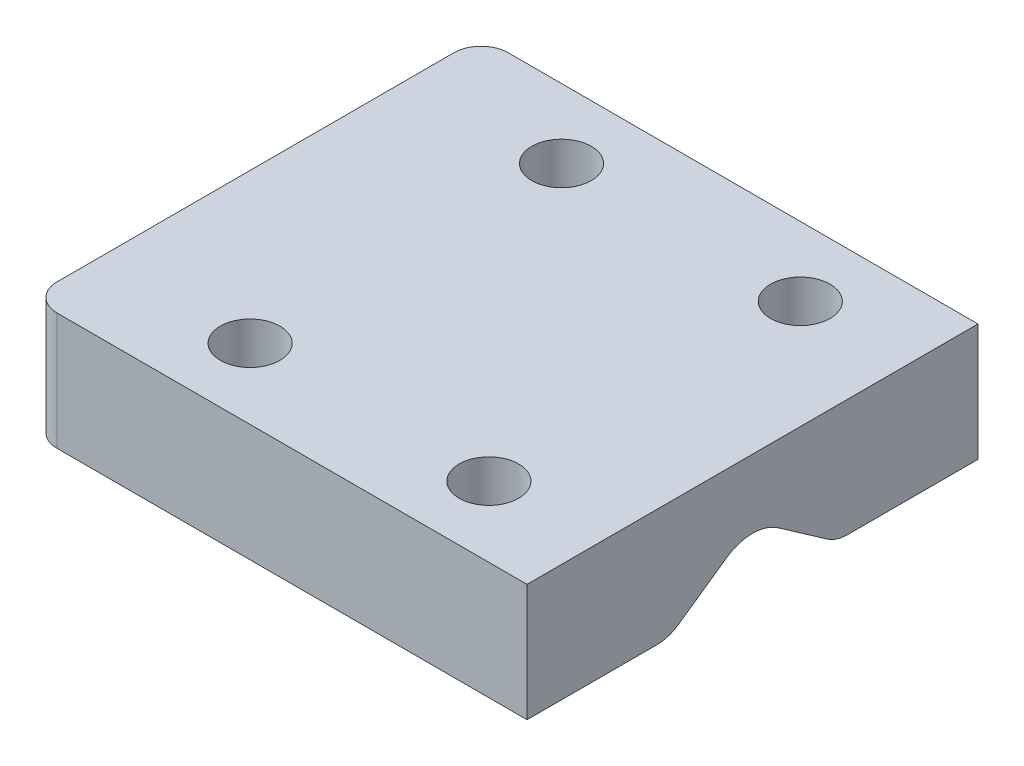
ISO-10303-21;
HEADER;
FILE_DESCRIPTION(('STEP AP214'),'2;1');
FILE_NAME('part.step','',(''),(''),'','','');
FILE_SCHEMA(('AUTOMOTIVE_DESIGN { 1 0 10303 214 1 1 1 1 }'));
ENDSEC;
DATA;
#1=APPLICATION_CONTEXT('core data for automotive mechanical design processes');
#2=APPLICATION_PROTOCOL_DEFINITION('international standard','automotive_design',2000,#1);
#3=PRODUCT_CONTEXT('',#1,'mechanical');
#4=PRODUCT('Part','Part','',(#3));
#5=PRODUCT_RELATED_PRODUCT_CATEGORY('part','',(#4));
#6=PRODUCT_DEFINITION_FORMATION('','',#4);
#7=PRODUCT_DEFINITION_CONTEXT('part definition',#1,'design');
#8=PRODUCT_DEFINITION('design','',#6,#7);
#9=PRODUCT_DEFINITION_SHAPE('','',#8);
#10=(LENGTH_UNIT() NAMED_UNIT(*) SI_UNIT(.MILLI.,.METRE.));
#11=(NAMED_UNIT(*) PLANE_ANGLE_UNIT() SI_UNIT($,.RADIAN.));
#12=(NAMED_UNIT(*) SI_UNIT($,.STERADIAN.) SOLID_ANGLE_UNIT());
#13=UNCERTAINTY_MEASURE_WITH_UNIT(LENGTH_MEASURE(1.E-05),#10,'distance_accuracy_value','');
#14=(GEOMETRIC_REPRESENTATION_CONTEXT(3) GLOBAL_UNCERTAINTY_ASSIGNED_CONTEXT((#13)) GLOBAL_UNIT_ASSIGNED_CONTEXT((#10,
#11,#12)) REPRESENTATION_CONTEXT('',''));
#15=CARTESIAN_POINT('',(0.,0.,0.));
#16=DIRECTION('',(0.,0.,1.));
#17=DIRECTION('',(1.,0.,0.));
#18=AXIS2_PLACEMENT_3D('',#15,#16,#17);
#19=CARTESIAN_POINT('',(0.,68.,0.));
#20=DIRECTION('',(0.,-1.,0.));
#21=DIRECTION('',(0.,0.,-1.));
#22=AXIS2_PLACEMENT_3D('',#19,#20,#21);
#23=PLANE('',#22);
#24=CARTESIAN_POINT('',(15.4737437034702,68.,-17.3243369322658));
#25=DIRECTION('',(0.,1.,0.));
#26=DIRECTION('',(0.,0.,1.));
#27=AXIS2_PLACEMENT_3D('',#24,#25,#26);
#28=CIRCLE('',#27,3.3);
#29=CARTESIAN_POINT('',(15.4737437034702,68.,-14.0243369322658));
#30=VERTEX_POINT('',#29);
#31=EDGE_CURVE('E287',#30,#30,#28,.T.);
#32=ORIENTED_EDGE('',*,*,#31,.T.);
#33=EDGE_LOOP('',(#32));
#34=FACE_BOUND('',#33,.T.);
#35=CARTESIAN_POINT('',(-11.,68.,-17.3243369322658));
#36=DIRECTION('',(0.,1.,0.));
#37=DIRECTION('',(0.,0.,1.));
#38=AXIS2_PLACEMENT_3D('',#35,#36,#37);
#39=CIRCLE('',#38,3.3);
#40=CARTESIAN_POINT('',(-11.,68.,-14.0243369322658));
#41=VERTEX_POINT('',#40);
#42=EDGE_CURVE('E288',#41,#41,#39,.T.);
#43=ORIENTED_EDGE('',*,*,#42,.T.);
#44=EDGE_LOOP('',(#43));
#45=FACE_BOUND('',#44,.T.);
#46=DIRECTION('',(0.,0.,-1.));
#47=VECTOR('',#46,1.);
#48=CARTESIAN_POINT('',(27.5,68.,-25.));
#49=LINE('',#48,#47);
#50=CARTESIAN_POINT('',(27.5,68.,-10.5441571993397));
#51=VERTEX_POINT('',#50);
#52=CARTESIAN_POINT('',(27.5,68.,-25.));
#53=VERTEX_POINT('',#52);
#54=EDGE_CURVE('E157',#51,#53,#49,.T.);
#55=ORIENTED_EDGE('',*,*,#54,.F.);
#56=DIRECTION('',(1.,0.,0.));
#57=VECTOR('',#56,1.);
#58=CARTESIAN_POINT('',(-27.5972353458108,68.,-10.5441571993397));
#59=LINE('',#58,#57);
#60=CARTESIAN_POINT('',(-27.5972353458108,68.,-10.5441571993397));
#61=VERTEX_POINT('',#60);
#62=EDGE_CURVE('E217',#51,#61,#59,.F.);
#63=ORIENTED_EDGE('',*,*,#62,.T.);
#64=DIRECTION('',(0.,0.,1.));
#65=VECTOR('',#64,1.);
#66=CARTESIAN_POINT('',(-27.5972353458108,68.,-25.));
#67=LINE('',#66,#65);
#68=CARTESIAN_POINT('',(-27.5972353458108,68.,-22.));
#69=VERTEX_POINT('',#68);
#70=EDGE_CURVE('E246',#69,#61,#67,.T.);
#71=ORIENTED_EDGE('',*,*,#70,.F.);
#72=CARTESIAN_POINT('',(-24.5972353458108,68.,-22.));
#73=DIRECTION('',(0.,-1.,0.));
#74=DIRECTION('',(0.,0.,-1.));
#75=AXIS2_PLACEMENT_3D('',#72,#73,#74);
#76=CIRCLE('',#75,3.);
#77=CARTESIAN_POINT('',(-24.5972353458108,68.,-25.));
#78=VERTEX_POINT('',#77);
#79=EDGE_CURVE('E187',#69,#78,#76,.T.);
#80=ORIENTED_EDGE('',*,*,#79,.T.);
#81=DIRECTION('',(-1.,0.,0.));
#82=VECTOR('',#81,1.);
#83=CARTESIAN_POINT('',(27.5,68.,-25.));
#84=LINE('',#83,#82);
#85=EDGE_CURVE('E237',#53,#78,#84,.T.);
#86=ORIENTED_EDGE('',*,*,#85,.F.);
#87=EDGE_LOOP('',(#55,#63,#71,#80,#86));
#88=FACE_BOUND('',#87,.T.);
#89=ADVANCED_FACE('F39',(#34,#45,#88),#23,.T.);
#90=CARTESIAN_POINT('',(27.5,81.,-25.));
#91=DIRECTION('',(-1.,0.,0.));
#92=DIRECTION('',(0.,0.,1.));
#93=AXIS2_PLACEMENT_3D('',#90,#91,#92);
#94=PLANE('',#93);
#95=DIRECTION('',(0.,0.573576436351044,0.819152044288993));
#96=VECTOR('',#95,1.);
#97=CARTESIAN_POINT('',(27.5,74.5,0.));
#98=LINE('',#97,#96);
#99=CARTESIAN_POINT('',(27.5,68.723391822844,-8.24985145393554));
#100=VERTEX_POINT('',#99);
#101=CARTESIAN_POINT('',(27.5,72.4918872776377,-2.86788218175522));
#102=VERTEX_POINT('',#101);
#103=EDGE_CURVE('E267',#100,#102,#98,.T.);
#104=ORIENTED_EDGE('',*,*,#103,.F.);
#105=CARTESIAN_POINT('',(27.5,72.,-10.5441571993397));
#106=DIRECTION('',(-1.,0.,0.));
#107=DIRECTION('',(0.,0.,1.));
#108=AXIS2_PLACEMENT_3D('',#105,#106,#107);
#109=CIRCLE('',#108,4.);
#110=EDGE_CURVE('E214',#100,#51,#109,.F.);
#111=ORIENTED_EDGE('',*,*,#110,.T.);
#112=ORIENTED_EDGE('',*,*,#54,.T.);
#113=DIRECTION('',(0.,-1.,0.));
#114=VECTOR('',#113,1.);
#115=CARTESIAN_POINT('',(27.5,81.,-25.));
#116=LINE('',#115,#114);
#117=CARTESIAN_POINT('',(27.5,81.,-25.));
#118=VERTEX_POINT('',#117);
#119=EDGE_CURVE('E134',#118,#53,#116,.T.);
#120=ORIENTED_EDGE('',*,*,#119,.F.);
#121=DIRECTION('',(0.,0.,-1.));
#122=VECTOR('',#121,1.);
#123=CARTESIAN_POINT('',(27.5,81.,-25.));
#124=LINE('',#123,#122);
#125=CARTESIAN_POINT('',(27.5,81.,25.));
#126=VERTEX_POINT('',#125);
#127=EDGE_CURVE('E141',#126,#118,#124,.T.);
#128=ORIENTED_EDGE('',*,*,#127,.F.);
#129=DIRECTION('',(0.,-1.,0.));
#130=VECTOR('',#129,1.);
#131=CARTESIAN_POINT('',(27.5,81.,25.));
#132=LINE('',#131,#130);
#133=CARTESIAN_POINT('',(27.5,68.,25.));
#134=VERTEX_POINT('',#133);
#135=EDGE_CURVE('E161',#126,#134,#132,.T.);
#136=ORIENTED_EDGE('',*,*,#135,.T.);
#137=CARTESIAN_POINT('',(27.5,68.,10.5441571993397));
#138=VERTEX_POINT('',#137);
#139=EDGE_CURVE('E232',#134,#138,#49,.T.);
#140=ORIENTED_EDGE('',*,*,#139,.T.);
#141=CARTESIAN_POINT('',(27.5,72.,10.5441571993397));
#142=DIRECTION('',(-1.,0.,0.));
#143=DIRECTION('',(0.,0.,1.));
#144=AXIS2_PLACEMENT_3D('',#141,#142,#143);
#145=CIRCLE('',#144,4.);
#146=CARTESIAN_POINT('',(27.5,68.723391822844,8.24985145393554));
#147=VERTEX_POINT('',#146);
#148=EDGE_CURVE('E211',#138,#147,#145,.F.);
#149=ORIENTED_EDGE('',*,*,#148,.T.);
#150=DIRECTION('',(0.,-0.573576436351044,0.819152044288993));
#151=VECTOR('',#150,1.);
#152=CARTESIAN_POINT('',(27.5,74.5,0.));
#153=LINE('',#152,#151);
#154=CARTESIAN_POINT('',(27.5,72.4918872776377,2.86788218175521));
#155=VERTEX_POINT('',#154);
#156=EDGE_CURVE('E263',#155,#147,#153,.T.);
#157=ORIENTED_EDGE('',*,*,#156,.F.);
#158=CARTESIAN_POINT('',(27.5,68.3961270561927,0.));
#159=DIRECTION('',(-1.,0.,0.));
#160=DIRECTION('',(0.,0.,1.));
#161=AXIS2_PLACEMENT_3D('',#158,#159,#160);
#162=CIRCLE('',#161,5.);
#163=EDGE_CURVE('E200',#155,#102,#162,.T.);
#164=ORIENTED_EDGE('',*,*,#163,.T.);
#165=EDGE_LOOP('',(#104,#111,#112,#120,#128,#136,#140,#149,#157,#164));
#166=FACE_BOUND('',#165,.T.);
#167=ADVANCED_FACE('F155',(#166),#94,.F.);
#168=CARTESIAN_POINT('',(27.5,81.,-25.));
#169=DIRECTION('',(0.,0.,1.));
#170=DIRECTION('',(1.,0.,0.));
#171=AXIS2_PLACEMENT_3D('',#168,#169,#170);
#172=PLANE('',#171);
#173=ORIENTED_EDGE('',*,*,#85,.T.);
#174=DIRECTION('',(0.,-1.,0.));
#175=VECTOR('',#174,1.);
#176=CARTESIAN_POINT('',(-24.5972353458108,81.,-25.));
#177=LINE('',#176,#175);
#178=CARTESIAN_POINT('',(-24.5972353458108,81.,-25.));
#179=VERTEX_POINT('',#178);
#180=EDGE_CURVE('E136',#78,#179,#177,.F.);
#181=ORIENTED_EDGE('',*,*,#180,.T.);
#182=DIRECTION('',(-1.,0.,0.));
#183=VECTOR('',#182,1.);
#184=CARTESIAN_POINT('',(27.5,81.,-25.));
#185=LINE('',#184,#183);
#186=EDGE_CURVE('E129',#118,#179,#185,.T.);
#187=ORIENTED_EDGE('',*,*,#186,.F.);
#188=ORIENTED_EDGE('',*,*,#119,.T.);
#189=EDGE_LOOP('',(#173,#181,#187,#188));
#190=FACE_BOUND('',#189,.T.);
#191=ADVANCED_FACE('F132',(#190),#172,.F.);
#192=CARTESIAN_POINT('',(-27.5972353458108,81.,-25.));
#193=DIRECTION('',(1.,0.,0.));
#194=DIRECTION('',(0.,0.,-1.));
#195=AXIS2_PLACEMENT_3D('',#192,#193,#194);
#196=PLANE('',#195);
#197=ORIENTED_EDGE('',*,*,#70,.T.);
#198=CARTESIAN_POINT('',(-27.5972353458108,72.,-10.5441571993397));
#199=DIRECTION('',(1.,0.,0.));
#200=DIRECTION('',(0.,0.,-1.));
#201=AXIS2_PLACEMENT_3D('',#198,#199,#200);
#202=CIRCLE('',#201,4.);
#203=CARTESIAN_POINT('',(-27.5972353458108,68.723391822844,-8.24985145393553));
#204=VERTEX_POINT('',#203);
#205=EDGE_CURVE('E222',#61,#204,#202,.F.);
#206=ORIENTED_EDGE('',*,*,#205,.T.);
#207=DIRECTION('',(0.,0.573576436351044,0.819152044288993));
#208=VECTOR('',#207,1.);
#209=CARTESIAN_POINT('',(-27.5972353458108,74.5,0.));
#210=LINE('',#209,#208);
#211=CARTESIAN_POINT('',(-27.5972353458108,72.4918872776377,-2.86788218175521));
#212=VERTEX_POINT('',#211);
#213=EDGE_CURVE('E266',#204,#212,#210,.T.);
#214=ORIENTED_EDGE('',*,*,#213,.T.);
#215=CARTESIAN_POINT('',(-27.5972353458108,68.3961270561927,0.));
#216=DIRECTION('',(1.,0.,0.));
#217=DIRECTION('',(0.,0.,-1.));
#218=AXIS2_PLACEMENT_3D('',#215,#216,#217);
#219=CIRCLE('',#218,5.);
#220=CARTESIAN_POINT('',(-27.5972353458108,72.4918872776377,2.86788218175522));
#221=VERTEX_POINT('',#220);
#222=EDGE_CURVE('E204',#212,#221,#219,.T.);
#223=ORIENTED_EDGE('',*,*,#222,.T.);
#224=DIRECTION('',(0.,-0.573576436351044,0.819152044288993));
#225=VECTOR('',#224,1.);
#226=CARTESIAN_POINT('',(-27.5972353458108,74.5,0.));
#227=LINE('',#226,#225);
#228=CARTESIAN_POINT('',(-27.5972353458108,68.723391822844,8.24985145393554));
#229=VERTEX_POINT('',#228);
#230=EDGE_CURVE('E242',#221,#229,#227,.T.);
#231=ORIENTED_EDGE('',*,*,#230,.T.);
#232=CARTESIAN_POINT('',(-27.5972353458108,72.,10.5441571993397));
#233=DIRECTION('',(1.,0.,0.));
#234=DIRECTION('',(0.,0.,-1.));
#235=AXIS2_PLACEMENT_3D('',#232,#233,#234);
#236=CIRCLE('',#235,4.);
#237=CARTESIAN_POINT('',(-27.5972353458108,68.,10.5441571993397));
#238=VERTEX_POINT('',#237);
#239=EDGE_CURVE('E60',#229,#238,#236,.F.);
#240=ORIENTED_EDGE('',*,*,#239,.T.);
#241=CARTESIAN_POINT('',(-27.5972353458108,68.,22.));
#242=VERTEX_POINT('',#241);
#243=EDGE_CURVE('E233',#238,#242,#67,.T.);
#244=ORIENTED_EDGE('',*,*,#243,.T.);
#245=DIRECTION('',(0.,-1.,0.));
#246=VECTOR('',#245,1.);
#247=CARTESIAN_POINT('',(-27.5972353458108,81.,22.));
#248=LINE('',#247,#246);
#249=CARTESIAN_POINT('',(-27.5972353458108,81.,22.));
#250=VERTEX_POINT('',#249);
#251=EDGE_CURVE('E178',#242,#250,#248,.F.);
#252=ORIENTED_EDGE('',*,*,#251,.T.);
#253=DIRECTION('',(0.,0.,1.));
#254=VECTOR('',#253,1.);
#255=CARTESIAN_POINT('',(-27.5972353458108,81.,-25.));
#256=LINE('',#255,#254);
#257=CARTESIAN_POINT('',(-27.5972353458108,81.,-22.));
#258=VERTEX_POINT('',#257);
#259=EDGE_CURVE('E140',#258,#250,#256,.T.);
#260=ORIENTED_EDGE('',*,*,#259,.F.);
#261=DIRECTION('',(0.,-1.,0.));
#262=VECTOR('',#261,1.);
#263=CARTESIAN_POINT('',(-27.5972353458108,81.,-22.));
#264=LINE('',#263,#262);
#265=EDGE_CURVE('E174',#258,#69,#264,.T.);
#266=ORIENTED_EDGE('',*,*,#265,.T.);
#267=EDGE_LOOP('',(#197,#206,#214,#223,#231,#240,#244,#252,#260,#266));
#268=FACE_BOUND('',#267,.T.);
#269=ADVANCED_FACE('F258',(#268),#196,.F.);
#270=CARTESIAN_POINT('',(27.5,81.,25.));
#271=DIRECTION('',(0.,0.,-1.));
#272=DIRECTION('',(-1.,0.,0.));
#273=AXIS2_PLACEMENT_3D('',#270,#271,#272);
#274=PLANE('',#273);
#275=DIRECTION('',(1.,0.,0.));
#276=VECTOR('',#275,1.);
#277=CARTESIAN_POINT('',(27.5,81.,25.));
#278=LINE('',#277,#276);
#279=CARTESIAN_POINT('',(-24.5972353458108,81.,25.));
#280=VERTEX_POINT('',#279);
#281=EDGE_CURVE('E147',#280,#126,#278,.T.);
#282=ORIENTED_EDGE('',*,*,#281,.F.);
#283=DIRECTION('',(0.,-1.,0.));
#284=VECTOR('',#283,1.);
#285=CARTESIAN_POINT('',(-24.5972353458108,81.,25.));
#286=LINE('',#285,#284);
#287=CARTESIAN_POINT('',(-24.5972353458108,68.,25.));
#288=VERTEX_POINT('',#287);
#289=EDGE_CURVE('E160',#280,#288,#286,.T.);
#290=ORIENTED_EDGE('',*,*,#289,.T.);
#291=DIRECTION('',(1.,0.,0.));
#292=VECTOR('',#291,1.);
#293=CARTESIAN_POINT('',(27.5,68.,25.));
#294=LINE('',#293,#292);
#295=EDGE_CURVE('E152',#288,#134,#294,.T.);
#296=ORIENTED_EDGE('',*,*,#295,.T.);
#297=ORIENTED_EDGE('',*,*,#135,.F.);
#298=EDGE_LOOP('',(#282,#290,#296,#297));
#299=FACE_BOUND('',#298,.T.);
#300=ADVANCED_FACE('F251',(#299),#274,.F.);
#301=CARTESIAN_POINT('',(0.,81.,0.));
#302=DIRECTION('',(0.,-1.,0.));
#303=DIRECTION('',(0.,0.,-1.));
#304=AXIS2_PLACEMENT_3D('',#301,#302,#303);
#305=PLANE('',#304);
#306=CARTESIAN_POINT('',(-11.,81.,17.201232434968));
#307=DIRECTION('',(0.,1.,0.));
#308=DIRECTION('',(0.,0.,1.));
#309=AXIS2_PLACEMENT_3D('',#306,#307,#308);
#310=CIRCLE('',#309,3.3);
#311=CARTESIAN_POINT('',(-11.,81.,20.501232434968));
#312=VERTEX_POINT('',#311);
#313=EDGE_CURVE('E292',#312,#312,#310,.T.);
#314=ORIENTED_EDGE('',*,*,#313,.F.);
#315=EDGE_LOOP('',(#314));
#316=FACE_BOUND('',#315,.T.);
#317=CARTESIAN_POINT('',(15.4737437034702,81.,-17.3243369322658));
#318=DIRECTION('',(0.,1.,0.));
#319=DIRECTION('',(0.,0.,1.));
#320=AXIS2_PLACEMENT_3D('',#317,#318,#319);
#321=CIRCLE('',#320,3.3);
#322=CARTESIAN_POINT('',(15.4737437034702,81.,-14.0243369322658));
#323=VERTEX_POINT('',#322);
#324=EDGE_CURVE('E283',#323,#323,#321,.T.);
#325=ORIENTED_EDGE('',*,*,#324,.F.);
#326=EDGE_LOOP('',(#325));
#327=FACE_BOUND('',#326,.T.);
#328=CARTESIAN_POINT('',(-11.,81.,-17.3243369322658));
#329=DIRECTION('',(0.,1.,0.));
#330=DIRECTION('',(0.,0.,1.));
#331=AXIS2_PLACEMENT_3D('',#328,#329,#330);
#332=CIRCLE('',#331,3.3);
#333=CARTESIAN_POINT('',(-11.,81.,-14.0243369322658));
#334=VERTEX_POINT('',#333);
#335=EDGE_CURVE('E299',#334,#334,#332,.T.);
#336=ORIENTED_EDGE('',*,*,#335,.F.);
#337=EDGE_LOOP('',(#336));
#338=FACE_BOUND('',#337,.T.);
#339=CARTESIAN_POINT('',(15.4737437034702,81.,17.2012324349681));
#340=DIRECTION('',(0.,1.,0.));
#341=DIRECTION('',(0.,0.,1.));
#342=AXIS2_PLACEMENT_3D('',#339,#340,#341);
#343=CIRCLE('',#342,3.3);
#344=CARTESIAN_POINT('',(15.4737437034702,81.,20.5012324349681));
#345=VERTEX_POINT('',#344);
#346=EDGE_CURVE('E275',#345,#345,#343,.T.);
#347=ORIENTED_EDGE('',*,*,#346,.F.);
#348=EDGE_LOOP('',(#347));
#349=FACE_BOUND('',#348,.T.);
#350=ORIENTED_EDGE('',*,*,#259,.T.);
#351=CARTESIAN_POINT('',(-24.5972353458108,81.,22.));
#352=DIRECTION('',(0.,-1.,0.));
#353=DIRECTION('',(0.,0.,-1.));
#354=AXIS2_PLACEMENT_3D('',#351,#352,#353);
#355=CIRCLE('',#354,3.);
#356=EDGE_CURVE('E184',#250,#280,#355,.F.);
#357=ORIENTED_EDGE('',*,*,#356,.T.);
#358=ORIENTED_EDGE('',*,*,#281,.T.);
#359=ORIENTED_EDGE('',*,*,#127,.T.);
#360=ORIENTED_EDGE('',*,*,#186,.T.);
#361=CARTESIAN_POINT('',(-24.5972353458108,81.,-22.));
#362=DIRECTION('',(0.,-1.,0.));
#363=DIRECTION('',(0.,0.,-1.));
#364=AXIS2_PLACEMENT_3D('',#361,#362,#363);
#365=CIRCLE('',#364,3.);
#366=EDGE_CURVE('E181',#179,#258,#365,.F.);
#367=ORIENTED_EDGE('',*,*,#366,.T.);
#368=EDGE_LOOP('',(#350,#357,#358,#359,#360,#367));
#369=FACE_BOUND('',#368,.T.);
#370=ADVANCED_FACE('F145',(#316,#327,#338,#349,#369),#305,.F.);
#371=CARTESIAN_POINT('',(-11.,68.,17.201232434968));
#372=DIRECTION('',(0.,1.,0.));
#373=DIRECTION('',(0.,0.,1.));
#374=AXIS2_PLACEMENT_3D('',#371,#372,#373);
#375=CIRCLE('',#374,3.3);
#376=CARTESIAN_POINT('',(-11.,68.,20.501232434968));
#377=VERTEX_POINT('',#376);
#378=EDGE_CURVE('E279',#377,#377,#375,.T.);
#379=ORIENTED_EDGE('',*,*,#378,.T.);
#380=EDGE_LOOP('',(#379));
#381=FACE_BOUND('',#380,.T.);
#382=CARTESIAN_POINT('',(15.4737437034702,68.,17.2012324349681));
#383=DIRECTION('',(0.,1.,0.));
#384=DIRECTION('',(0.,0.,1.));
#385=AXIS2_PLACEMENT_3D('',#382,#383,#384);
#386=CIRCLE('',#385,3.3);
#387=CARTESIAN_POINT('',(15.4737437034702,68.,20.5012324349681));
#388=VERTEX_POINT('',#387);
#389=EDGE_CURVE('E270',#388,#388,#386,.T.);
#390=ORIENTED_EDGE('',*,*,#389,.T.);
#391=EDGE_LOOP('',(#390));
#392=FACE_BOUND('',#391,.T.);
#393=ORIENTED_EDGE('',*,*,#243,.F.);
#394=DIRECTION('',(1.,0.,0.));
#395=VECTOR('',#394,1.);
#396=CARTESIAN_POINT('',(27.5,68.,10.5441571993397));
#397=LINE('',#396,#395);
#398=EDGE_CURVE('E48',#238,#138,#397,.T.);
#399=ORIENTED_EDGE('',*,*,#398,.T.);
#400=ORIENTED_EDGE('',*,*,#139,.F.);
#401=ORIENTED_EDGE('',*,*,#295,.F.);
#402=CARTESIAN_POINT('',(-24.5972353458108,68.,22.));
#403=DIRECTION('',(0.,-1.,0.));
#404=DIRECTION('',(0.,0.,-1.));
#405=AXIS2_PLACEMENT_3D('',#402,#403,#404);
#406=CIRCLE('',#405,3.);
#407=EDGE_CURVE('E166',#288,#242,#406,.T.);
#408=ORIENTED_EDGE('',*,*,#407,.T.);
#409=EDGE_LOOP('',(#393,#399,#400,#401,#408));
#410=FACE_BOUND('',#409,.T.);
#411=ADVANCED_FACE('F230',(#381,#392,#410),#23,.T.);
#412=CARTESIAN_POINT('',(-27.5972353458108,74.5,0.));
#413=DIRECTION('',(0.,0.819152044288993,-0.573576436351044));
#414=DIRECTION('',(0.,0.573576436351044,0.819152044288993));
#415=AXIS2_PLACEMENT_3D('',#412,#413,#414);
#416=PLANE('',#415);
#417=ORIENTED_EDGE('',*,*,#213,.F.);
#418=DIRECTION('',(1.,0.,0.));
#419=VECTOR('',#418,1.);
#420=CARTESIAN_POINT('',(27.5,68.723391822844,-8.24985145393554));
#421=LINE('',#420,#419);
#422=EDGE_CURVE('E207',#204,#100,#421,.T.);
#423=ORIENTED_EDGE('',*,*,#422,.T.);
#424=ORIENTED_EDGE('',*,*,#103,.T.);
#425=DIRECTION('',(1.,0.,0.));
#426=VECTOR('',#425,1.);
#427=CARTESIAN_POINT('',(-27.5972353458108,72.4918872776377,-2.86788218175521));
#428=LINE('',#427,#426);
#429=EDGE_CURVE('E196',#102,#212,#428,.F.);
#430=ORIENTED_EDGE('',*,*,#429,.T.);
#431=EDGE_LOOP('',(#417,#423,#424,#430));
#432=FACE_BOUND('',#431,.T.);
#433=ADVANCED_FACE('F348',(#432),#416,.F.);
#434=CARTESIAN_POINT('',(-27.5972353458108,74.5,0.));
#435=DIRECTION('',(0.,0.819152044288993,0.573576436351044));
#436=DIRECTION('',(0.,-0.573576436351044,0.819152044288993));
#437=AXIS2_PLACEMENT_3D('',#434,#435,#436);
#438=PLANE('',#437);
#439=ORIENTED_EDGE('',*,*,#156,.T.);
#440=DIRECTION('',(1.,0.,0.));
#441=VECTOR('',#440,1.);
#442=CARTESIAN_POINT('',(-27.5972353458108,68.723391822844,8.24985145393554));
#443=LINE('',#442,#441);
#444=EDGE_CURVE('E11',#147,#229,#443,.F.);
#445=ORIENTED_EDGE('',*,*,#444,.T.);
#446=ORIENTED_EDGE('',*,*,#230,.F.);
#447=DIRECTION('',(1.,0.,0.));
#448=VECTOR('',#447,1.);
#449=CARTESIAN_POINT('',(27.5,72.4918872776377,2.86788218175522));
#450=LINE('',#449,#448);
#451=EDGE_CURVE('E192',#221,#155,#450,.T.);
#452=ORIENTED_EDGE('',*,*,#451,.T.);
#453=EDGE_LOOP('',(#439,#445,#446,#452));
#454=FACE_BOUND('',#453,.T.);
#455=ADVANCED_FACE('F353',(#454),#438,.F.);
#456=CARTESIAN_POINT('',(-24.5972353458108,81.,22.));
#457=DIRECTION('',(0.,-1.,0.));
#458=DIRECTION('',(0.,0.,-1.));
#459=AXIS2_PLACEMENT_3D('',#456,#457,#458);
#460=CYLINDRICAL_SURFACE('',#459,3.);
#461=ORIENTED_EDGE('',*,*,#356,.F.);
#462=ORIENTED_EDGE('',*,*,#251,.F.);
#463=ORIENTED_EDGE('',*,*,#407,.F.);
#464=ORIENTED_EDGE('',*,*,#289,.F.);
#465=EDGE_LOOP('',(#461,#462,#463,#464));
#466=FACE_BOUND('',#465,.T.);
#467=ADVANCED_FACE('F256',(#466),#460,.T.);
#468=CARTESIAN_POINT('',(-24.5972353458108,81.,-22.));
#469=DIRECTION('',(0.,-1.,0.));
#470=DIRECTION('',(0.,0.,-1.));
#471=AXIS2_PLACEMENT_3D('',#468,#469,#470);
#472=CYLINDRICAL_SURFACE('',#471,3.);
#473=ORIENTED_EDGE('',*,*,#366,.F.);
#474=ORIENTED_EDGE('',*,*,#180,.F.);
#475=ORIENTED_EDGE('',*,*,#79,.F.);
#476=ORIENTED_EDGE('',*,*,#265,.F.);
#477=EDGE_LOOP('',(#473,#474,#475,#476));
#478=FACE_BOUND('',#477,.T.);
#479=ADVANCED_FACE('F325',(#478),#472,.T.);
#480=CARTESIAN_POINT('',(15.4737437034702,68.,17.2012324349681));
#481=DIRECTION('',(0.,1.,0.));
#482=DIRECTION('',(0.,0.,1.));
#483=AXIS2_PLACEMENT_3D('',#480,#481,#482);
#484=CYLINDRICAL_SURFACE('',#483,3.3);
#485=ORIENTED_EDGE('',*,*,#389,.F.);
#486=EDGE_LOOP('',(#485));
#487=FACE_BOUND('',#486,.T.);
#488=ORIENTED_EDGE('',*,*,#346,.T.);
#489=EDGE_LOOP('',(#488));
#490=FACE_BOUND('',#489,.T.);
#491=ADVANCED_FACE('F323',(#487,#490),#484,.F.);
#492=CARTESIAN_POINT('',(-11.,68.,17.201232434968));
#493=DIRECTION('',(0.,1.,0.));
#494=DIRECTION('',(0.,0.,1.));
#495=AXIS2_PLACEMENT_3D('',#492,#493,#494);
#496=CYLINDRICAL_SURFACE('',#495,3.3);
#497=ORIENTED_EDGE('',*,*,#378,.F.);
#498=EDGE_LOOP('',(#497));
#499=FACE_BOUND('',#498,.T.);
#500=ORIENTED_EDGE('',*,*,#313,.T.);
#501=EDGE_LOOP('',(#500));
#502=FACE_BOUND('',#501,.T.);
#503=ADVANCED_FACE('F313',(#499,#502),#496,.F.);
#504=CARTESIAN_POINT('',(-11.,68.,-17.3243369322658));
#505=DIRECTION('',(0.,1.,0.));
#506=DIRECTION('',(0.,0.,1.));
#507=AXIS2_PLACEMENT_3D('',#504,#505,#506);
#508=CYLINDRICAL_SURFACE('',#507,3.3);
#509=ORIENTED_EDGE('',*,*,#42,.F.);
#510=EDGE_LOOP('',(#509));
#511=FACE_BOUND('',#510,.T.);
#512=ORIENTED_EDGE('',*,*,#335,.T.);
#513=EDGE_LOOP('',(#512));
#514=FACE_BOUND('',#513,.T.);
#515=ADVANCED_FACE('F309',(#511,#514),#508,.F.);
#516=CARTESIAN_POINT('',(15.4737437034702,68.,-17.3243369322658));
#517=DIRECTION('',(0.,1.,0.));
#518=DIRECTION('',(0.,0.,1.));
#519=AXIS2_PLACEMENT_3D('',#516,#517,#518);
#520=CYLINDRICAL_SURFACE('',#519,3.3);
#521=ORIENTED_EDGE('',*,*,#31,.F.);
#522=EDGE_LOOP('',(#521));
#523=FACE_BOUND('',#522,.T.);
#524=ORIENTED_EDGE('',*,*,#324,.T.);
#525=EDGE_LOOP('',(#524));
#526=FACE_BOUND('',#525,.T.);
#527=ADVANCED_FACE('F312',(#523,#526),#520,.F.);
#528=CARTESIAN_POINT('',(-27.5972353458108,68.3961270561927,0.));
#529=DIRECTION('',(-1.,0.,0.));
#530=DIRECTION('',(0.,0.,1.));
#531=AXIS2_PLACEMENT_3D('',#528,#529,#530);
#532=CYLINDRICAL_SURFACE('',#531,5.);
#533=ORIENTED_EDGE('',*,*,#222,.F.);
#534=ORIENTED_EDGE('',*,*,#429,.F.);
#535=ORIENTED_EDGE('',*,*,#163,.F.);
#536=ORIENTED_EDGE('',*,*,#451,.F.);
#537=EDGE_LOOP('',(#533,#534,#535,#536));
#538=FACE_BOUND('',#537,.T.);
#539=ADVANCED_FACE('F364',(#538),#532,.F.);
#540=CARTESIAN_POINT('',(-27.5972353458108,72.,-10.5441571993397));
#541=DIRECTION('',(-1.,0.,0.));
#542=DIRECTION('',(0.,0.,1.));
#543=AXIS2_PLACEMENT_3D('',#540,#541,#542);
#544=CYLINDRICAL_SURFACE('',#543,4.);
#545=ORIENTED_EDGE('',*,*,#205,.F.);
#546=ORIENTED_EDGE('',*,*,#62,.F.);
#547=ORIENTED_EDGE('',*,*,#110,.F.);
#548=ORIENTED_EDGE('',*,*,#422,.F.);
#549=EDGE_LOOP('',(#545,#546,#547,#548));
#550=FACE_BOUND('',#549,.T.);
#551=ADVANCED_FACE('F369',(#550),#544,.T.);
#552=CARTESIAN_POINT('',(0.,72.,10.5441571993397));
#553=DIRECTION('',(-1.,0.,0.));
#554=DIRECTION('',(0.,0.,1.));
#555=AXIS2_PLACEMENT_3D('',#552,#553,#554);
#556=CYLINDRICAL_SURFACE('',#555,4.);
#557=ORIENTED_EDGE('',*,*,#239,.F.);
#558=ORIENTED_EDGE('',*,*,#444,.F.);
#559=ORIENTED_EDGE('',*,*,#148,.F.);
#560=ORIENTED_EDGE('',*,*,#398,.F.);
#561=EDGE_LOOP('',(#557,#558,#559,#560));
#562=FACE_BOUND('',#561,.T.);
#563=ADVANCED_FACE('F41',(#562),#556,.T.);
#564=CLOSED_SHELL('',(#89,#167,#191,#269,#300,#370,#411,#433,#455,#467,#479,#491,#503,#515,#527,
#539,#551,#563));
#565=MANIFOLD_SOLID_BREP('B2',#564);
#566=ADVANCED_BREP_SHAPE_REPRESENTATION('',(#18,#565),#14);
#567=SHAPE_DEFINITION_REPRESENTATION(#9,#566);
ENDSEC;
END-ISO-10303-21;
